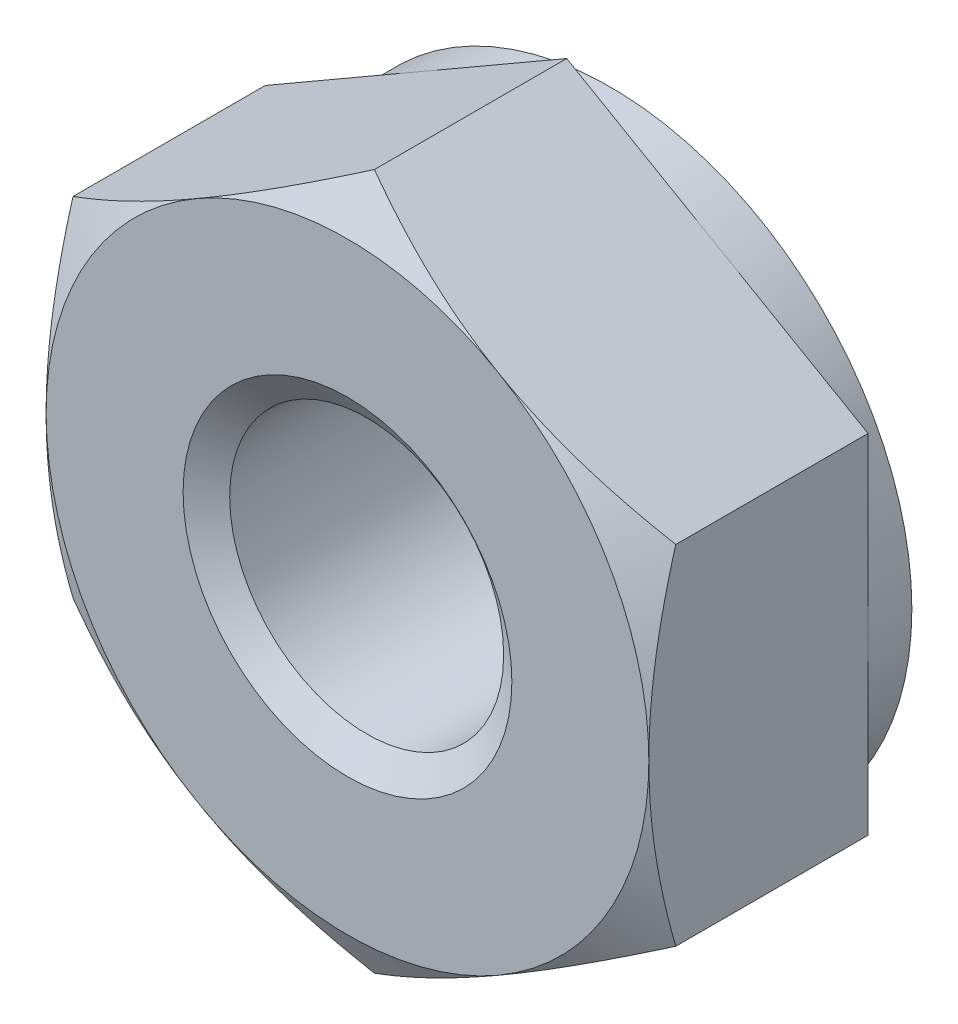
ISO-10303-21;
HEADER;
FILE_DESCRIPTION(('STEP AP214'),'2;1');
FILE_NAME('part.step','',(''),(''),'','','');
FILE_SCHEMA(('AUTOMOTIVE_DESIGN { 1 0 10303 214 1 1 1 1 }'));
ENDSEC;
DATA;
#1=APPLICATION_CONTEXT('core data for automotive mechanical design processes');
#2=APPLICATION_PROTOCOL_DEFINITION('international standard','automotive_design',2000,#1);
#3=PRODUCT_CONTEXT('',#1,'mechanical');
#4=PRODUCT('Part','Part','',(#3));
#5=PRODUCT_RELATED_PRODUCT_CATEGORY('part','',(#4));
#6=PRODUCT_DEFINITION_FORMATION('','',#4);
#7=PRODUCT_DEFINITION_CONTEXT('part definition',#1,'design');
#8=PRODUCT_DEFINITION('design','',#6,#7);
#9=PRODUCT_DEFINITION_SHAPE('','',#8);
#10=(LENGTH_UNIT() NAMED_UNIT(*) SI_UNIT(.MILLI.,.METRE.));
#11=(NAMED_UNIT(*) PLANE_ANGLE_UNIT() SI_UNIT($,.RADIAN.));
#12=(NAMED_UNIT(*) SI_UNIT($,.STERADIAN.) SOLID_ANGLE_UNIT());
#13=UNCERTAINTY_MEASURE_WITH_UNIT(LENGTH_MEASURE(1.E-05),#10,'distance_accuracy_value','');
#14=(GEOMETRIC_REPRESENTATION_CONTEXT(3) GLOBAL_UNCERTAINTY_ASSIGNED_CONTEXT((#13)) GLOBAL_UNIT_ASSIGNED_CONTEXT((#10,
#11,#12)) REPRESENTATION_CONTEXT('',''));
#15=CARTESIAN_POINT('',(0.,0.,0.));
#16=DIRECTION('',(0.,0.,1.));
#17=DIRECTION('',(1.,0.,0.));
#18=AXIS2_PLACEMENT_3D('',#15,#16,#17);
#19=CARTESIAN_POINT('',(0.,0.,-2.4));
#20=DIRECTION('',(0.,0.,1.));
#21=DIRECTION('',(1.,0.,0.));
#22=AXIS2_PLACEMENT_3D('',#19,#20,#21);
#23=CYLINDRICAL_SURFACE('',#22,1.25);
#24=CARTESIAN_POINT('',(0.,0.,-0.175051884552426));
#25=DIRECTION('',(0.,0.,1.));
#26=DIRECTION('',(1.,0.,0.));
#27=AXIS2_PLACEMENT_3D('',#24,#25,#26);
#28=CIRCLE('',#27,1.25);
#29=CARTESIAN_POINT('',(1.25,0.,-0.175051884552426));
#30=VERTEX_POINT('',#29);
#31=EDGE_CURVE('E153',#30,#30,#28,.F.);
#32=ORIENTED_EDGE('',*,*,#31,.F.);
#33=EDGE_LOOP('',(#32));
#34=FACE_BOUND('',#33,.T.);
#35=CARTESIAN_POINT('',(0.,0.,-2.19954811544757));
#36=DIRECTION('',(0.,0.,-1.));
#37=DIRECTION('',(-1.,0.,0.));
#38=AXIS2_PLACEMENT_3D('',#35,#36,#37);
#39=CIRCLE('',#38,1.25);
#40=CARTESIAN_POINT('',(-1.25,0.,-2.19954811544757));
#41=VERTEX_POINT('',#40);
#42=EDGE_CURVE('E41',#41,#41,#39,.F.);
#43=ORIENTED_EDGE('',*,*,#42,.F.);
#44=EDGE_LOOP('',(#43));
#45=FACE_BOUND('',#44,.T.);
#46=ADVANCED_FACE('F36',(#34,#45),#23,.F.);
#47=CARTESIAN_POINT('',(0.,3.17542648054294,-2.4));
#48=DIRECTION('',(-0.5,0.866025403784438,0.));
#49=DIRECTION('',(-0.866025403784439,-0.5,0.));
#50=AXIS2_PLACEMENT_3D('',#47,#48,#49);
#51=PLANE('',#50);
#52=DIRECTION('',(0.,0.,1.));
#53=VECTOR('',#52,1.);
#54=CARTESIAN_POINT('',(-2.75,1.58771324027147,-2.4));
#55=LINE('',#54,#53);
#56=CARTESIAN_POINT('',(-2.75,1.58771324027147,-2.));
#57=VERTEX_POINT('',#56);
#58=CARTESIAN_POINT('',(-2.75,1.58771324027147,-0.245620093061864));
#59=VERTEX_POINT('',#58);
#60=EDGE_CURVE('E294',#57,#59,#55,.T.);
#61=ORIENTED_EDGE('',*,*,#60,.T.);
#62=CARTESIAN_POINT('',(-2.7502,1.58759777021763,-0.245686763364762));
#63=CARTESIAN_POINT('',(-2.62935077934009,1.65737010029699,-0.205387662249264));
#64=CARTESIAN_POINT('',(-2.50745839737737,1.72774469983533,-0.168736902597663));
#65=CARTESIAN_POINT('',(-2.26156287327211,1.86971254687003,-0.104762182969801));
#66=CARTESIAN_POINT('',(-2.13755536142614,1.94130831721583,-0.0774608556744977));
#67=CARTESIAN_POINT('',(-1.89107720202405,2.08361254889599,-0.034961745294117));
#68=CARTESIAN_POINT('',(-1.76864448141258,2.15429911309864,-0.0194811186224577));
#69=CARTESIAN_POINT('',(-1.52320285763108,2.29600490065923,-0.000999397369940291));
#70=CARTESIAN_POINT('',(-1.40019484676709,2.36702360884404,0.00201700053740032));
#71=CARTESIAN_POINT('',(-1.17034121338921,2.49972966594897,-0.00425314542854684));
#72=CARTESIAN_POINT('',(-1.06346120874598,2.56143686540073,-0.0120001542767026));
#73=CARTESIAN_POINT('',(-0.850397532665249,2.68444923614047,-0.0365551810643552));
#74=CARTESIAN_POINT('',(-0.74421459835111,2.74575398185008,-0.0533715896505709));
#75=CARTESIAN_POINT('',(-0.530711510606815,2.86902004703207,-0.0954119223459574));
#76=CARTESIAN_POINT('',(-0.423418383857144,2.93096576264318,-0.120814080687232));
#77=CARTESIAN_POINT('',(-0.210432520715948,3.05393320806134,-0.178467225839984));
#78=CARTESIAN_POINT('',(-0.104737054973346,3.11495651365995,-0.210704663298984));
#79=CARTESIAN_POINT('',(0.000200000000000739,3.17554195059678,-0.245686763364762));
#80=B_SPLINE_CURVE_WITH_KNOTS('',3,(#62,#63,#64,#65,#66,#67,#68,#69,#70,#71,#72,#73,#74,#75,#76,
#77,#78,#79),.UNSPECIFIED.,.F.,.F.,(4,2,2,2,2,2,2,2,4),(0.,0.435912828725889,0.872873557116334,
1.29901931904672,1.72464171213574,2.09526089052938,2.46622354066374,2.84541551798557,
3.22386274754524),.UNSPECIFIED.);
#81=CARTESIAN_POINT('',(-1.375,2.38156986040721,0.));
#82=VERTEX_POINT('',#81);
#83=EDGE_CURVE('E60',#59,#82,#80,.T.);
#84=ORIENTED_EDGE('',*,*,#83,.T.);
#85=CARTESIAN_POINT('',(0.,3.17542648054294,-0.245620093061864));
#86=VERTEX_POINT('',#85);
#87=EDGE_CURVE('E167',#82,#86,#80,.T.);
#88=ORIENTED_EDGE('',*,*,#87,.T.);
#89=DIRECTION('',(0.,0.,1.));
#90=VECTOR('',#89,1.);
#91=CARTESIAN_POINT('',(0.,3.17542648054294,-2.4));
#92=LINE('',#91,#90);
#93=CARTESIAN_POINT('',(0.,3.17542648054294,-2.));
#94=VERTEX_POINT('',#93);
#95=EDGE_CURVE('E282',#94,#86,#92,.T.);
#96=ORIENTED_EDGE('',*,*,#95,.F.);
#97=DIRECTION('',(-0.866025403784439,-0.5,0.));
#98=VECTOR('',#97,1.);
#99=CARTESIAN_POINT('',(0.,3.17542648054294,-2.));
#100=LINE('',#99,#98);
#101=CARTESIAN_POINT('',(-1.375,2.38156986040721,-2.));
#102=VERTEX_POINT('',#101);
#103=EDGE_CURVE('E270',#94,#102,#100,.T.);
#104=ORIENTED_EDGE('',*,*,#103,.T.);
#105=EDGE_CURVE('E266',#102,#57,#100,.T.);
#106=ORIENTED_EDGE('',*,*,#105,.T.);
#107=EDGE_LOOP('',(#61,#84,#88,#96,#104,#106));
#108=FACE_BOUND('',#107,.T.);
#109=ADVANCED_FACE('F38',(#108),#51,.T.);
#110=CARTESIAN_POINT('',(2.75,1.58771324027147,-2.4));
#111=DIRECTION('',(0.500000000000001,0.866025403784438,0.));
#112=DIRECTION('',(-0.866025403784438,0.500000000000001,0.));
#113=AXIS2_PLACEMENT_3D('',#110,#111,#112);
#114=PLANE('',#113);
#115=ORIENTED_EDGE('',*,*,#95,.T.);
#116=CARTESIAN_POINT('',(-0.000199999999999462,3.17554195059678,-0.245686763364762));
#117=CARTESIAN_POINT('',(0.120649220659907,3.10576962051743,-0.205387662249265));
#118=CARTESIAN_POINT('',(0.242541602622635,3.03539502097908,-0.168736902597663));
#119=CARTESIAN_POINT('',(0.488437126727894,2.89342717394439,-0.104762182969801));
#120=CARTESIAN_POINT('',(0.612444638573857,2.82183140359858,-0.0774608556744977));
#121=CARTESIAN_POINT('',(0.858922797975945,2.67952717191842,-0.0349617452941167));
#122=CARTESIAN_POINT('',(0.981355518587418,2.60884060771577,-0.0194811186224576));
#123=CARTESIAN_POINT('',(1.22679714236892,2.46713482015518,-0.000999397369940055));
#124=CARTESIAN_POINT('',(1.34980515323291,2.39611611197037,0.00201700053740075));
#125=CARTESIAN_POINT('',(1.57965878661079,2.26341005486544,-0.00425314542854627));
#126=CARTESIAN_POINT('',(1.68653879125402,2.20170285541368,-0.012000154276702));
#127=CARTESIAN_POINT('',(1.89960246733475,2.07869048467395,-0.0365551810643545));
#128=CARTESIAN_POINT('',(2.00578540164889,2.01738573896433,-0.0533715896505701));
#129=CARTESIAN_POINT('',(2.21928848939318,1.89411967378235,-0.0954119223459562));
#130=CARTESIAN_POINT('',(2.32658161614286,1.83217395817123,-0.120814080687231));
#131=CARTESIAN_POINT('',(2.53956747928405,1.70920651275307,-0.178467225839982));
#132=CARTESIAN_POINT('',(2.64526294502665,1.64818320715446,-0.210704663298983));
#133=CARTESIAN_POINT('',(2.7502,1.58759777021763,-0.245686763364761));
#134=B_SPLINE_CURVE_WITH_KNOTS('',3,(#116,#117,#118,#119,#120,#121,#122,#123,#124,#125,#126,
#127,#128,#129,#130,#131,#132,#133),.UNSPECIFIED.,.F.,.F.,(4,2,2,2,2,2,2,2,4),(0.,
0.435912828725889,0.872873557116333,1.29901931904672,1.72464171213574,2.09526089052938,
2.46622354066374,2.84541551798557,3.22386274754524),.UNSPECIFIED.);
#135=CARTESIAN_POINT('',(1.375,2.3815698604072,0.));
#136=VERTEX_POINT('',#135);
#137=EDGE_CURVE('E164',#86,#136,#134,.T.);
#138=ORIENTED_EDGE('',*,*,#137,.T.);
#139=CARTESIAN_POINT('',(2.75,1.58771324027147,-0.245620093061864));
#140=VERTEX_POINT('',#139);
#141=EDGE_CURVE('E147',#136,#140,#134,.T.);
#142=ORIENTED_EDGE('',*,*,#141,.T.);
#143=DIRECTION('',(0.,0.,1.));
#144=VECTOR('',#143,1.);
#145=CARTESIAN_POINT('',(2.75,1.58771324027147,-2.4));
#146=LINE('',#145,#144);
#147=CARTESIAN_POINT('',(2.75,1.58771324027147,-2.));
#148=VERTEX_POINT('',#147);
#149=EDGE_CURVE('E163',#148,#140,#146,.T.);
#150=ORIENTED_EDGE('',*,*,#149,.F.);
#151=DIRECTION('',(-0.866025403784438,0.500000000000001,0.));
#152=VECTOR('',#151,1.);
#153=CARTESIAN_POINT('',(2.75,1.58771324027147,-2.));
#154=LINE('',#153,#152);
#155=CARTESIAN_POINT('',(1.375,2.38156986040721,-2.));
#156=VERTEX_POINT('',#155);
#157=EDGE_CURVE('E278',#148,#156,#154,.T.);
#158=ORIENTED_EDGE('',*,*,#157,.T.);
#159=EDGE_CURVE('E274',#156,#94,#154,.T.);
#160=ORIENTED_EDGE('',*,*,#159,.T.);
#161=EDGE_LOOP('',(#115,#138,#142,#150,#158,#160));
#162=FACE_BOUND('',#161,.T.);
#163=ADVANCED_FACE('F241',(#162),#114,.T.);
#164=CARTESIAN_POINT('',(2.75,1.58771324027147,-2.4));
#165=DIRECTION('',(-1.,0.,0.));
#166=DIRECTION('',(0.,0.,1.));
#167=AXIS2_PLACEMENT_3D('',#164,#165,#166);
#168=PLANE('',#167);
#169=CARTESIAN_POINT('',(2.75,-4.21084949309676,-1.31594843960294));
#170=CARTESIAN_POINT('',(2.75,-4.0901089421409,-1.25759993615224));
#171=CARTESIAN_POINT('',(2.75,-3.96908292065509,-1.19983146511759));
#172=CARTESIAN_POINT('',(2.75,-3.72630558284844,-1.08578603842305));
#173=CARTESIAN_POINT('',(2.75,-3.604554145362,-1.02950934100247));
#174=CARTESIAN_POINT('',(2.75,-3.35951393034354,-0.918482443352759));
#175=CARTESIAN_POINT('',(2.75,-3.23622034236436,-0.86374282160584));
#176=CARTESIAN_POINT('',(2.75,-2.98861980138743,-0.756614777476455));
#177=CARTESIAN_POINT('',(2.75,-2.86431290161182,-0.704226232536765));
#178=CARTESIAN_POINT('',(2.75,-2.61294485887172,-0.601803572146125));
#179=CARTESIAN_POINT('',(2.75,-2.48586863815654,-0.551806257898394));
#180=CARTESIAN_POINT('',(2.75,-2.23021732171541,-0.455727408784602));
#181=CARTESIAN_POINT('',(2.75,-2.10164206103363,-0.409646309576972));
#182=CARTESIAN_POINT('',(2.75,-1.84305218799467,-0.322638077046232));
#183=CARTESIAN_POINT('',(2.75,-1.71304130052583,-0.281699986413889));
#184=CARTESIAN_POINT('',(2.75,-1.45117125062148,-0.206307307624348));
#185=CARTESIAN_POINT('',(2.75,-1.31931268690202,-0.171850669152767));
#186=CARTESIAN_POINT('',(2.75,-1.05365722480012,-0.111093671530904));
#187=CARTESIAN_POINT('',(2.75,-0.919859820217592,-0.0847954840951217));
#188=CARTESIAN_POINT('',(2.75,-0.650651874037381,-0.0421260371966114));
#189=CARTESIAN_POINT('',(2.75,-0.515241331013595,-0.0257547865105431));
#190=CARTESIAN_POINT('',(2.75,-0.244373242869211,-0.00438749654023741));
#191=CARTESIAN_POINT('',(2.75,-0.108921526377133,0.000680556773215934));
#192=CARTESIAN_POINT('',(2.75,0.161887058855134,-0.000827795632671984));
#193=CARTESIAN_POINT('',(2.75,0.297243943089641,-0.00740117868555361));
#194=CARTESIAN_POINT('',(2.75,0.528385436717542,-0.0281041300468438));
#195=CARTESIAN_POINT('',(2.75,0.624425050137501,-0.0395376410301884));
#196=CARTESIAN_POINT('',(2.75,0.815762399811543,-0.0675217196133512));
#197=CARTESIAN_POINT('',(2.75,0.911060016631966,-0.0840730942276825));
#198=CARTESIAN_POINT('',(2.75,1.19576218748916,-0.140535361278284));
#199=CARTESIAN_POINT('',(2.75,1.38383224738496,-0.187239859417294));
#200=CARTESIAN_POINT('',(2.75,1.66525048947485,-0.267792497030578));
#201=CARTESIAN_POINT('',(2.75,1.76006556248558,-0.296803334995501));
#202=CARTESIAN_POINT('',(2.75,1.94870609382215,-0.357695648906588));
#203=CARTESIAN_POINT('',(2.75,2.04253218553696,-0.389575144878503));
#204=CARTESIAN_POINT('',(2.75,2.22880240354984,-0.455541418186448));
#205=CARTESIAN_POINT('',(2.75,2.32125133588451,-0.489614761455532));
#206=CARTESIAN_POINT('',(2.75,2.50543192042628,-0.559761368231109));
#207=CARTESIAN_POINT('',(2.75,2.59716326539579,-0.595835440037317));
#208=CARTESIAN_POINT('',(2.75,2.68856293053345,-0.632712441997484));
#209=B_SPLINE_CURVE_WITH_KNOTS('',3,(#169,#170,#171,#172,#173,#174,#175,#176,#177,#178,#179,
#180,#181,#182,#183,#184,#185,#186,#187,#188,#189,#190,#191,#192,#193,#194,#195,#196,#197,#198,
#199,#200,#201,#202,#203,#204,#205,#206,#207,#208),.UNSPECIFIED.,.F.,.F.,(4,2,2,2,2,2,2,2,2,2,2,
2,2,2,2,2,2,2,2,4),(0.,0.402305607365936,0.804680408536997,1.20935783819118,1.61401414820818,
2.0236383818577,2.43330812457349,2.842089694796,3.25074173456636,3.65950246109143,
4.06826354901184,4.4744128402465,4.88045669141172,5.17046846817546,5.46052599902452,
6.04107275309883,6.33851131304661,6.63574613017455,6.93130791005792,7.22698998004822),.UNSPECIFIED.);
#210=CARTESIAN_POINT('',(2.75,-1.58771324027147,-0.245620093061864));
#211=VERTEX_POINT('',#210);
#212=CARTESIAN_POINT('',(2.75,0.,0.));
#213=VERTEX_POINT('',#212);
#214=EDGE_CURVE('E128',#211,#213,#209,.T.);
#215=ORIENTED_EDGE('',*,*,#214,.F.);
#216=DIRECTION('',(0.,0.,1.));
#217=VECTOR('',#216,1.);
#218=CARTESIAN_POINT('',(2.75,-1.58771324027147,-2.4));
#219=LINE('',#218,#217);
#220=CARTESIAN_POINT('',(2.75,-1.58771324027147,-2.));
#221=VERTEX_POINT('',#220);
#222=EDGE_CURVE('E287',#221,#211,#219,.T.);
#223=ORIENTED_EDGE('',*,*,#222,.F.);
#224=DIRECTION('',(0.,-1.,0.));
#225=VECTOR('',#224,1.);
#226=CARTESIAN_POINT('',(2.75,1.58771324027147,-2.));
#227=LINE('',#226,#225);
#228=CARTESIAN_POINT('',(2.75,0.,-2.));
#229=VERTEX_POINT('',#228);
#230=EDGE_CURVE('E279',#229,#221,#227,.T.);
#231=ORIENTED_EDGE('',*,*,#230,.F.);
#232=EDGE_CURVE('E281',#148,#229,#227,.T.);
#233=ORIENTED_EDGE('',*,*,#232,.F.);
#234=ORIENTED_EDGE('',*,*,#149,.T.);
#235=EDGE_CURVE('E141',#213,#140,#209,.T.);
#236=ORIENTED_EDGE('',*,*,#235,.F.);
#237=EDGE_LOOP('',(#215,#223,#231,#233,#234,#236));
#238=FACE_BOUND('',#237,.T.);
#239=ADVANCED_FACE('F160',(#238),#168,.F.);
#240=CARTESIAN_POINT('',(0.,-3.17542648054295,-2.4));
#241=DIRECTION('',(0.5,-0.866025403784439,0.));
#242=DIRECTION('',(0.866025403784439,0.5,0.));
#243=AXIS2_PLACEMENT_3D('',#240,#241,#242);
#244=PLANE('',#243);
#245=ORIENTED_EDGE('',*,*,#222,.T.);
#246=CARTESIAN_POINT('',(2.7502,-1.58759777021764,-0.245686763364762));
#247=CARTESIAN_POINT('',(2.62935077934009,-1.65737010029699,-0.205387662249265));
#248=CARTESIAN_POINT('',(2.50745839737737,-1.72774469983534,-0.168736902597663));
#249=CARTESIAN_POINT('',(2.26156287327211,-1.86971254687003,-0.104762182969802));
#250=CARTESIAN_POINT('',(2.13755536142614,-1.94130831721583,-0.0774608556744985));
#251=CARTESIAN_POINT('',(1.89107720202405,-2.08361254889599,-0.0349617452941179));
#252=CARTESIAN_POINT('',(1.76864448141258,-2.15429911309864,-0.0194811186224588));
#253=CARTESIAN_POINT('',(1.52320285763108,-2.29600490065923,-0.000999397369941431));
#254=CARTESIAN_POINT('',(1.40019484676709,-2.36702360884404,0.00201700053739928));
#255=CARTESIAN_POINT('',(1.1703412133892,-2.49972966594897,-0.00425314542854804));
#256=CARTESIAN_POINT('',(1.06346120874598,-2.56143686540073,-0.012000154276704));
#257=CARTESIAN_POINT('',(0.850397532665248,-2.68444923614047,-0.0365551810643568));
#258=CARTESIAN_POINT('',(0.744214598351109,-2.74575398185008,-0.0533715896505724));
#259=CARTESIAN_POINT('',(0.530711510606815,-2.86902004703207,-0.0954119223459588));
#260=CARTESIAN_POINT('',(0.423418383857143,-2.93096576264319,-0.120814080687233));
#261=CARTESIAN_POINT('',(0.210432520715948,-3.05393320806134,-0.178467225839985));
#262=CARTESIAN_POINT('',(0.104737054973347,-3.11495651365995,-0.210704663298985));
#263=CARTESIAN_POINT('',(-0.000200000000000457,-3.17554195059678,-0.245686763364763));
#264=B_SPLINE_CURVE_WITH_KNOTS('',3,(#246,#247,#248,#249,#250,#251,#252,#253,#254,#255,#256,
#257,#258,#259,#260,#261,#262,#263),.UNSPECIFIED.,.F.,.F.,(4,2,2,2,2,2,2,2,4),(0.,
0.435912828725889,0.872873557116334,1.29901931904672,1.72464171213574,2.09526089052938,
2.46622354066375,2.84541551798557,3.22386274754524),.UNSPECIFIED.);
#265=CARTESIAN_POINT('',(1.375,-2.38156986040721,0.));
#266=VERTEX_POINT('',#265);
#267=EDGE_CURVE('E135',#211,#266,#264,.T.);
#268=ORIENTED_EDGE('',*,*,#267,.T.);
#269=CARTESIAN_POINT('',(0.,-3.17542648054294,-0.245620093061864));
#270=VERTEX_POINT('',#269);
#271=EDGE_CURVE('E175',#266,#270,#264,.T.);
#272=ORIENTED_EDGE('',*,*,#271,.T.);
#273=DIRECTION('',(0.,0.,1.));
#274=VECTOR('',#273,1.);
#275=CARTESIAN_POINT('',(0.,-3.17542648054295,-2.4));
#276=LINE('',#275,#274);
#277=CARTESIAN_POINT('',(0.,-3.17542648054295,-2.));
#278=VERTEX_POINT('',#277);
#279=EDGE_CURVE('E289',#278,#270,#276,.T.);
#280=ORIENTED_EDGE('',*,*,#279,.F.);
#281=DIRECTION('',(0.866025403784439,0.5,0.));
#282=VECTOR('',#281,1.);
#283=CARTESIAN_POINT('',(0.,-3.17542648054295,-2.));
#284=LINE('',#283,#282);
#285=CARTESIAN_POINT('',(1.375,-2.38156986040721,-2.));
#286=VERTEX_POINT('',#285);
#287=EDGE_CURVE('E271',#278,#286,#284,.T.);
#288=ORIENTED_EDGE('',*,*,#287,.T.);
#289=EDGE_CURVE('E275',#286,#221,#284,.T.);
#290=ORIENTED_EDGE('',*,*,#289,.T.);
#291=EDGE_LOOP('',(#245,#268,#272,#280,#288,#290));
#292=FACE_BOUND('',#291,.T.);
#293=ADVANCED_FACE('F222',(#292),#244,.T.);
#294=CARTESIAN_POINT('',(-2.75,-1.58771324027147,-2.4));
#295=DIRECTION('',(-0.500000000000001,-0.866025403784438,0.));
#296=DIRECTION('',(0.866025403784438,-0.500000000000001,0.));
#297=AXIS2_PLACEMENT_3D('',#294,#295,#296);
#298=PLANE('',#297);
#299=ORIENTED_EDGE('',*,*,#279,.T.);
#300=CARTESIAN_POINT('',(0.000199999999999374,-3.17554195059678,-0.245686763364763));
#301=CARTESIAN_POINT('',(-0.120649220659907,-3.10576962051743,-0.205387662249266));
#302=CARTESIAN_POINT('',(-0.242541602622635,-3.03539502097908,-0.168736902597664));
#303=CARTESIAN_POINT('',(-0.488437126727894,-2.89342717394439,-0.104762182969802));
#304=CARTESIAN_POINT('',(-0.612444638573857,-2.82183140359859,-0.0774608556744988));
#305=CARTESIAN_POINT('',(-0.858922797975946,-2.67952717191843,-0.0349617452941179));
#306=CARTESIAN_POINT('',(-0.981355518587419,-2.60884060771577,-0.0194811186224589));
#307=CARTESIAN_POINT('',(-1.22679714236892,-2.46713482015519,-0.000999397369941341));
#308=CARTESIAN_POINT('',(-1.34980515323291,-2.39611611197038,0.00201700053739963));
#309=CARTESIAN_POINT('',(-1.5796587866108,-2.26341005486544,-0.00425314542854729));
#310=CARTESIAN_POINT('',(-1.68653879125402,-2.20170285541369,-0.012000154276703));
#311=CARTESIAN_POINT('',(-1.89960246733475,-2.07869048467395,-0.0365551810643555));
#312=CARTESIAN_POINT('',(-2.00578540164889,-2.01738573896433,-0.0533715896505711));
#313=CARTESIAN_POINT('',(-2.21928848939318,-1.89411967378235,-0.0954119223459572));
#314=CARTESIAN_POINT('',(-2.32658161614286,-1.83217395817123,-0.120814080687232));
#315=CARTESIAN_POINT('',(-2.53956747928405,-1.70920651275308,-0.178467225839983));
#316=CARTESIAN_POINT('',(-2.64526294502665,-1.64818320715446,-0.210704663298984));
#317=CARTESIAN_POINT('',(-2.7502,-1.58759777021763,-0.245686763364762));
#318=B_SPLINE_CURVE_WITH_KNOTS('',3,(#300,#301,#302,#303,#304,#305,#306,#307,#308,#309,#310,
#311,#312,#313,#314,#315,#316,#317),.UNSPECIFIED.,.F.,.F.,(4,2,2,2,2,2,2,2,4),(0.,
0.435912828725889,0.872873557116334,1.29901931904672,1.72464171213574,2.09526089052938,
2.46622354066375,2.84541551798557,3.22386274754524),.UNSPECIFIED.);
#319=CARTESIAN_POINT('',(-1.375,-2.38156986040721,0.));
#320=VERTEX_POINT('',#319);
#321=EDGE_CURVE('E216',#270,#320,#318,.T.);
#322=ORIENTED_EDGE('',*,*,#321,.T.);
#323=CARTESIAN_POINT('',(-2.75,-1.58771324027147,-0.245620093061864));
#324=VERTEX_POINT('',#323);
#325=EDGE_CURVE('E208',#320,#324,#318,.T.);
#326=ORIENTED_EDGE('',*,*,#325,.T.);
#327=DIRECTION('',(0.,0.,1.));
#328=VECTOR('',#327,1.);
#329=CARTESIAN_POINT('',(-2.75,-1.58771324027147,-2.4));
#330=LINE('',#329,#328);
#331=CARTESIAN_POINT('',(-2.75,-1.58771324027147,-2.));
#332=VERTEX_POINT('',#331);
#333=EDGE_CURVE('E292',#332,#324,#330,.T.);
#334=ORIENTED_EDGE('',*,*,#333,.F.);
#335=DIRECTION('',(0.866025403784438,-0.500000000000001,0.));
#336=VECTOR('',#335,1.);
#337=CARTESIAN_POINT('',(-2.75,-1.58771324027147,-2.));
#338=LINE('',#337,#336);
#339=CARTESIAN_POINT('',(-1.375,-2.38156986040721,-2.));
#340=VERTEX_POINT('',#339);
#341=EDGE_CURVE('E261',#332,#340,#338,.T.);
#342=ORIENTED_EDGE('',*,*,#341,.T.);
#343=EDGE_CURVE('E267',#340,#278,#338,.T.);
#344=ORIENTED_EDGE('',*,*,#343,.T.);
#345=EDGE_LOOP('',(#299,#322,#326,#334,#342,#344));
#346=FACE_BOUND('',#345,.T.);
#347=ADVANCED_FACE('F218',(#346),#298,.T.);
#348=CARTESIAN_POINT('',(-2.75,1.58771324027147,-2.4));
#349=DIRECTION('',(-1.,0.,0.));
#350=DIRECTION('',(0.,0.,1.));
#351=AXIS2_PLACEMENT_3D('',#348,#349,#350);
#352=PLANE('',#351);
#353=ORIENTED_EDGE('',*,*,#333,.T.);
#354=CARTESIAN_POINT('',(-2.75,-4.21084949309676,-1.31594843960294));
#355=CARTESIAN_POINT('',(-2.75,-4.0901089421409,-1.25759993615224));
#356=CARTESIAN_POINT('',(-2.75,-3.96908292065509,-1.19983146511759));
#357=CARTESIAN_POINT('',(-2.75,-3.72630558284843,-1.08578603842305));
#358=CARTESIAN_POINT('',(-2.75,-3.604554145362,-1.02950934100247));
#359=CARTESIAN_POINT('',(-2.75,-3.35951393034354,-0.918482443352758));
#360=CARTESIAN_POINT('',(-2.75,-3.23622034236436,-0.863742821605839));
#361=CARTESIAN_POINT('',(-2.75,-2.98861980138743,-0.756614777476454));
#362=CARTESIAN_POINT('',(-2.75,-2.86431290161182,-0.704226232536764));
#363=CARTESIAN_POINT('',(-2.75,-2.61294485887172,-0.601803572146124));
#364=CARTESIAN_POINT('',(-2.75,-2.48586863815654,-0.551806257898393));
#365=CARTESIAN_POINT('',(-2.75,-2.2302173217154,-0.455727408784601));
#366=CARTESIAN_POINT('',(-2.75,-2.10164206103363,-0.409646309576971));
#367=CARTESIAN_POINT('',(-2.75,-1.84305218799467,-0.322638077046231));
#368=CARTESIAN_POINT('',(-2.75,-1.71304130052583,-0.281699986413888));
#369=CARTESIAN_POINT('',(-2.75,-1.45117125062147,-0.206307307624348));
#370=CARTESIAN_POINT('',(-2.75,-1.31931268690202,-0.171850669152767));
#371=CARTESIAN_POINT('',(-2.75,-1.05365722480012,-0.111093671530904));
#372=CARTESIAN_POINT('',(-2.75,-0.91985982021759,-0.0847954840951212));
#373=CARTESIAN_POINT('',(-2.75,-0.650651874037379,-0.0421260371966109));
#374=CARTESIAN_POINT('',(-2.75,-0.515241331013593,-0.025754786510543));
#375=CARTESIAN_POINT('',(-2.75,-0.244373242869209,-0.00438749654023751));
#376=CARTESIAN_POINT('',(-2.75,-0.108921526377131,0.000680556773215974));
#377=CARTESIAN_POINT('',(-2.75,0.161887058855136,-0.000827795632672024));
#378=CARTESIAN_POINT('',(-2.75,0.297243943089643,-0.00740117868555387));
#379=CARTESIAN_POINT('',(-2.75,0.528385436717545,-0.0281041300468441));
#380=CARTESIAN_POINT('',(-2.75,0.624425050137503,-0.0395376410301886));
#381=CARTESIAN_POINT('',(-2.75,0.815762399811546,-0.0675217196133515));
#382=CARTESIAN_POINT('',(-2.75,0.911060016631968,-0.0840730942276829));
#383=CARTESIAN_POINT('',(-2.75,1.19576218748917,-0.140535361278285));
#384=CARTESIAN_POINT('',(-2.75,1.38383224738497,-0.187239859417294));
#385=CARTESIAN_POINT('',(-2.75,1.66525048947485,-0.267792497030579));
#386=CARTESIAN_POINT('',(-2.75,1.76006556248558,-0.296803334995501));
#387=CARTESIAN_POINT('',(-2.75,1.94870609382215,-0.357695648906588));
#388=CARTESIAN_POINT('',(-2.75,2.04253218553696,-0.389575144878504));
#389=CARTESIAN_POINT('',(-2.75,2.22880240354985,-0.455541418186449));
#390=CARTESIAN_POINT('',(-2.75,2.32125133588451,-0.489614761455533));
#391=CARTESIAN_POINT('',(-2.75,2.50543192042629,-0.55976136823111));
#392=CARTESIAN_POINT('',(-2.75,2.59716326539579,-0.595835440037319));
#393=CARTESIAN_POINT('',(-2.75,2.68856293053346,-0.632712441997485));
#394=B_SPLINE_CURVE_WITH_KNOTS('',3,(#354,#355,#356,#357,#358,#359,#360,#361,#362,#363,#364,
#365,#366,#367,#368,#369,#370,#371,#372,#373,#374,#375,#376,#377,#378,#379,#380,#381,#382,#383,
#384,#385,#386,#387,#388,#389,#390,#391,#392,#393),.UNSPECIFIED.,.F.,.F.,(4,2,2,2,2,2,2,2,2,2,2,
2,2,2,2,2,2,2,2,4),(0.,0.402305607365936,0.804680408536997,1.20935783819118,1.61401414820818,
2.0236383818577,2.43330812457349,2.842089694796,3.25074173456636,3.65950246109143,
4.06826354901184,4.4744128402465,4.88045669141172,5.17046846817546,5.46052599902452,
6.04107275309883,6.33851131304661,6.63574613017454,6.93130791005792,7.22698998004822),.UNSPECIFIED.);
#395=CARTESIAN_POINT('',(-2.75,0.,0.));
#396=VERTEX_POINT('',#395);
#397=EDGE_CURVE('E217',#324,#396,#394,.T.);
#398=ORIENTED_EDGE('',*,*,#397,.T.);
#399=EDGE_CURVE('E152',#396,#59,#394,.T.);
#400=ORIENTED_EDGE('',*,*,#399,.T.);
#401=ORIENTED_EDGE('',*,*,#60,.F.);
#402=DIRECTION('',(0.,-1.,0.));
#403=VECTOR('',#402,1.);
#404=CARTESIAN_POINT('',(-2.75,1.58771324027147,-2.));
#405=LINE('',#404,#403);
#406=CARTESIAN_POINT('',(-2.75,0.,-2.));
#407=VERTEX_POINT('',#406);
#408=EDGE_CURVE('E301',#57,#407,#405,.T.);
#409=ORIENTED_EDGE('',*,*,#408,.T.);
#410=EDGE_CURVE('E299',#407,#332,#405,.T.);
#411=ORIENTED_EDGE('',*,*,#410,.T.);
#412=EDGE_LOOP('',(#353,#398,#400,#401,#409,#411));
#413=FACE_BOUND('',#412,.T.);
#414=ADVANCED_FACE('F221',(#413),#352,.T.);
#415=CARTESIAN_POINT('',(0.,3.17542648054294,0.));
#416=DIRECTION('',(0.,0.,-1.));
#417=DIRECTION('',(-1.,0.,0.));
#418=AXIS2_PLACEMENT_3D('',#415,#416,#417);
#419=PLANE('',#418);
#420=CARTESIAN_POINT('',(0.,0.,0.));
#421=DIRECTION('',(0.,0.,1.));
#422=DIRECTION('',(1.,0.,0.));
#423=AXIS2_PLACEMENT_3D('',#420,#421,#422);
#424=CIRCLE('',#423,1.5);
#425=CARTESIAN_POINT('',(1.5,0.,0.));
#426=VERTEX_POINT('',#425);
#427=EDGE_CURVE('E304',#426,#426,#424,.T.);
#428=ORIENTED_EDGE('',*,*,#427,.F.);
#429=EDGE_LOOP('',(#428));
#430=FACE_BOUND('',#429,.T.);
#431=CARTESIAN_POINT('',(0.,0.,0.));
#432=DIRECTION('',(0.,0.,-1.));
#433=DIRECTION('',(-1.,0.,0.));
#434=AXIS2_PLACEMENT_3D('',#431,#432,#433);
#435=CIRCLE('',#434,2.75);
#436=EDGE_CURVE('E48',#82,#396,#435,.F.);
#437=ORIENTED_EDGE('',*,*,#436,.T.);
#438=EDGE_CURVE('E12',#396,#320,#435,.F.);
#439=ORIENTED_EDGE('',*,*,#438,.T.);
#440=EDGE_CURVE('E46',#320,#266,#435,.F.);
#441=ORIENTED_EDGE('',*,*,#440,.T.);
#442=EDGE_CURVE('E132',#266,#213,#435,.F.);
#443=ORIENTED_EDGE('',*,*,#442,.T.);
#444=CARTESIAN_POINT('',(0.,0.,0.));
#445=DIRECTION('',(0.,0.,1.));
#446=DIRECTION('',(1.,0.,0.));
#447=AXIS2_PLACEMENT_3D('',#444,#445,#446);
#448=CIRCLE('',#447,2.75);
#449=EDGE_CURVE('E144',#213,#136,#448,.T.);
#450=ORIENTED_EDGE('',*,*,#449,.T.);
#451=EDGE_CURVE('E158',#136,#82,#435,.F.);
#452=ORIENTED_EDGE('',*,*,#451,.T.);
#453=EDGE_LOOP('',(#437,#439,#441,#443,#450,#452));
#454=FACE_BOUND('',#453,.T.);
#455=ADVANCED_FACE('F156',(#430,#454),#419,.F.);
#456=CARTESIAN_POINT('',(0.,3.17542648054294,-2.4));
#457=DIRECTION('',(0.,0.,-1.));
#458=DIRECTION('',(-1.,0.,0.));
#459=AXIS2_PLACEMENT_3D('',#456,#457,#458);
#460=PLANE('',#459);
#461=CARTESIAN_POINT('',(0.,0.,-2.4));
#462=DIRECTION('',(0.,0.,-1.));
#463=DIRECTION('',(-1.,0.,0.));
#464=AXIS2_PLACEMENT_3D('',#461,#462,#463);
#465=CIRCLE('',#464,1.5);
#466=CARTESIAN_POINT('',(-1.5,0.,-2.4));
#467=VERTEX_POINT('',#466);
#468=EDGE_CURVE('E305',#467,#467,#465,.F.);
#469=ORIENTED_EDGE('',*,*,#468,.T.);
#470=EDGE_LOOP('',(#469));
#471=FACE_BOUND('',#470,.T.);
#472=CARTESIAN_POINT('',(0.,0.,-2.4));
#473=DIRECTION('',(0.,0.,-1.));
#474=DIRECTION('',(-1.,0.,0.));
#475=AXIS2_PLACEMENT_3D('',#472,#473,#474);
#476=CIRCLE('',#475,2.75);
#477=CARTESIAN_POINT('',(-2.75,0.,-2.4));
#478=VERTEX_POINT('',#477);
#479=EDGE_CURVE('E285',#478,#478,#476,.F.);
#480=ORIENTED_EDGE('',*,*,#479,.F.);
#481=EDGE_LOOP('',(#480));
#482=FACE_BOUND('',#481,.T.);
#483=ADVANCED_FACE('F231',(#471,#482),#460,.T.);
#484=CARTESIAN_POINT('',(0.,13.1754264805429,-2.));
#485=DIRECTION('',(0.,0.,-1.));
#486=DIRECTION('',(-1.,0.,0.));
#487=AXIS2_PLACEMENT_3D('',#484,#485,#486);
#488=PLANE('',#487);
#489=ORIENTED_EDGE('',*,*,#232,.T.);
#490=CARTESIAN_POINT('',(0.,0.,-2.));
#491=DIRECTION('',(0.,0.,1.));
#492=DIRECTION('',(1.,0.,0.));
#493=AXIS2_PLACEMENT_3D('',#490,#491,#492);
#494=CIRCLE('',#493,2.75);
#495=EDGE_CURVE('E258',#229,#156,#494,.T.);
#496=ORIENTED_EDGE('',*,*,#495,.T.);
#497=ORIENTED_EDGE('',*,*,#157,.F.);
#498=EDGE_LOOP('',(#489,#496,#497));
#499=FACE_BOUND('',#498,.T.);
#500=ADVANCED_FACE('F248',(#499),#488,.T.);
#501=ORIENTED_EDGE('',*,*,#230,.T.);
#502=ORIENTED_EDGE('',*,*,#289,.F.);
#503=EDGE_CURVE('E263',#286,#229,#494,.T.);
#504=ORIENTED_EDGE('',*,*,#503,.T.);
#505=EDGE_LOOP('',(#501,#502,#504));
#506=FACE_BOUND('',#505,.T.);
#507=ADVANCED_FACE('F451',(#506),#488,.T.);
#508=EDGE_CURVE('E262',#156,#102,#494,.T.);
#509=ORIENTED_EDGE('',*,*,#508,.T.);
#510=ORIENTED_EDGE('',*,*,#103,.F.);
#511=ORIENTED_EDGE('',*,*,#159,.F.);
#512=EDGE_LOOP('',(#509,#510,#511));
#513=FACE_BOUND('',#512,.T.);
#514=ADVANCED_FACE('F442',(#513),#488,.T.);
#515=ORIENTED_EDGE('',*,*,#343,.F.);
#516=EDGE_CURVE('E515',#340,#286,#494,.T.);
#517=ORIENTED_EDGE('',*,*,#516,.T.);
#518=ORIENTED_EDGE('',*,*,#287,.F.);
#519=EDGE_LOOP('',(#515,#517,#518));
#520=FACE_BOUND('',#519,.T.);
#521=ADVANCED_FACE('F433',(#520),#488,.T.);
#522=EDGE_CURVE('E529',#102,#407,#494,.T.);
#523=ORIENTED_EDGE('',*,*,#522,.T.);
#524=ORIENTED_EDGE('',*,*,#408,.F.);
#525=ORIENTED_EDGE('',*,*,#105,.F.);
#526=EDGE_LOOP('',(#523,#524,#525));
#527=FACE_BOUND('',#526,.T.);
#528=ADVANCED_FACE('F417',(#527),#488,.T.);
#529=CARTESIAN_POINT('',(0.,0.,0.));
#530=DIRECTION('',(0.,0.,1.));
#531=DIRECTION('',(1.,0.,0.));
#532=AXIS2_PLACEMENT_3D('',#529,#530,#531);
#533=CYLINDRICAL_SURFACE('',#532,2.75);
#534=ORIENTED_EDGE('',*,*,#479,.T.);
#535=EDGE_LOOP('',(#534));
#536=FACE_BOUND('',#535,.T.);
#537=ORIENTED_EDGE('',*,*,#508,.F.);
#538=ORIENTED_EDGE('',*,*,#495,.F.);
#539=ORIENTED_EDGE('',*,*,#503,.F.);
#540=ORIENTED_EDGE('',*,*,#516,.F.);
#541=EDGE_CURVE('E531',#407,#340,#494,.T.);
#542=ORIENTED_EDGE('',*,*,#541,.F.);
#543=ORIENTED_EDGE('',*,*,#522,.F.);
#544=EDGE_LOOP('',(#537,#538,#539,#540,#542,#543));
#545=FACE_BOUND('',#544,.T.);
#546=ADVANCED_FACE('F246',(#536,#545),#533,.T.);
#547=ORIENTED_EDGE('',*,*,#410,.F.);
#548=ORIENTED_EDGE('',*,*,#541,.T.);
#549=ORIENTED_EDGE('',*,*,#341,.F.);
#550=EDGE_LOOP('',(#547,#548,#549));
#551=FACE_BOUND('',#550,.T.);
#552=ADVANCED_FACE('F197',(#551),#488,.T.);
#553=CARTESIAN_POINT('',(0.,0.,0.));
#554=DIRECTION('',(0.,0.,-1.));
#555=DIRECTION('',(-1.,0.,0.));
#556=AXIS2_PLACEMENT_3D('',#553,#554,#555);
#557=CONICAL_SURFACE('',#556,2.75,1.0471975511966);
#558=ORIENTED_EDGE('',*,*,#399,.F.);
#559=ORIENTED_EDGE('',*,*,#436,.F.);
#560=ORIENTED_EDGE('',*,*,#83,.F.);
#561=EDGE_LOOP('',(#558,#559,#560));
#562=FACE_BOUND('',#561,.T.);
#563=ADVANCED_FACE('F379',(#562),#557,.T.);
#564=ORIENTED_EDGE('',*,*,#451,.F.);
#565=ORIENTED_EDGE('',*,*,#137,.F.);
#566=ORIENTED_EDGE('',*,*,#87,.F.);
#567=EDGE_LOOP('',(#564,#565,#566));
#568=FACE_BOUND('',#567,.T.);
#569=ADVANCED_FACE('F195',(#568),#557,.T.);
#570=ORIENTED_EDGE('',*,*,#449,.F.);
#571=ORIENTED_EDGE('',*,*,#235,.T.);
#572=ORIENTED_EDGE('',*,*,#141,.F.);
#573=EDGE_LOOP('',(#570,#571,#572));
#574=FACE_BOUND('',#573,.T.);
#575=ADVANCED_FACE('F145',(#574),#557,.T.);
#576=ORIENTED_EDGE('',*,*,#214,.T.);
#577=ORIENTED_EDGE('',*,*,#442,.F.);
#578=ORIENTED_EDGE('',*,*,#267,.F.);
#579=EDGE_LOOP('',(#576,#577,#578));
#580=FACE_BOUND('',#579,.T.);
#581=ADVANCED_FACE('F130',(#580),#557,.T.);
#582=ORIENTED_EDGE('',*,*,#440,.F.);
#583=ORIENTED_EDGE('',*,*,#321,.F.);
#584=ORIENTED_EDGE('',*,*,#271,.F.);
#585=EDGE_LOOP('',(#582,#583,#584));
#586=FACE_BOUND('',#585,.T.);
#587=ADVANCED_FACE('F194',(#586),#557,.T.);
#588=ORIENTED_EDGE('',*,*,#438,.F.);
#589=ORIENTED_EDGE('',*,*,#397,.F.);
#590=ORIENTED_EDGE('',*,*,#325,.F.);
#591=EDGE_LOOP('',(#588,#589,#590));
#592=FACE_BOUND('',#591,.T.);
#593=ADVANCED_FACE('F188',(#592),#557,.T.);
#594=CARTESIAN_POINT('',(0.,0.,-0.192557073007669));
#595=DIRECTION('',(0.,0.,1.));
#596=DIRECTION('',(1.,0.,0.));
#597=AXIS2_PLACEMENT_3D('',#594,#595,#596);
#598=CONICAL_SURFACE('',#597,1.225,0.959931088596884);
#599=ORIENTED_EDGE('',*,*,#427,.T.);
#600=EDGE_LOOP('',(#599));
#601=FACE_BOUND('',#600,.T.);
#602=ORIENTED_EDGE('',*,*,#31,.T.);
#603=EDGE_LOOP('',(#602));
#604=FACE_BOUND('',#603,.T.);
#605=ADVANCED_FACE('F193',(#601,#604),#598,.F.);
#606=CARTESIAN_POINT('',(0.,0.,-2.3746));
#607=DIRECTION('',(0.,0.,-1.));
#608=DIRECTION('',(-1.,0.,0.));
#609=AXIS2_PLACEMENT_3D('',#606,#607,#608);
#610=CONICAL_SURFACE('',#609,1.5,0.959931088596876);
#611=CARTESIAN_POINT('',(0.,0.,-2.3746));
#612=DIRECTION('',(0.,0.,1.));
#613=DIRECTION('',(1.,0.,0.));
#614=AXIS2_PLACEMENT_3D('',#611,#612,#613);
#615=CIRCLE('',#614,1.5);
#616=CARTESIAN_POINT('',(1.5,0.,-2.3746));
#617=VERTEX_POINT('',#616);
#618=EDGE_CURVE('E307',#617,#617,#615,.T.);
#619=ORIENTED_EDGE('',*,*,#618,.F.);
#620=EDGE_LOOP('',(#619));
#621=FACE_BOUND('',#620,.T.);
#622=ORIENTED_EDGE('',*,*,#42,.T.);
#623=EDGE_LOOP('',(#622));
#624=FACE_BOUND('',#623,.T.);
#625=ADVANCED_FACE('F320',(#621,#624),#610,.F.);
#626=CARTESIAN_POINT('',(0.,0.,-25.0375057290932));
#627=DIRECTION('',(0.,0.,1.));
#628=DIRECTION('',(1.,0.,0.));
#629=AXIS2_PLACEMENT_3D('',#626,#627,#628);
#630=CYLINDRICAL_SURFACE('',#629,1.5);
#631=ORIENTED_EDGE('',*,*,#468,.F.);
#632=EDGE_LOOP('',(#631));
#633=FACE_BOUND('',#632,.T.);
#634=ORIENTED_EDGE('',*,*,#618,.T.);
#635=EDGE_LOOP('',(#634));
#636=FACE_BOUND('',#635,.T.);
#637=ADVANCED_FACE('F324',(#633,#636),#630,.F.);
#638=CLOSED_SHELL('',(#46,#109,#163,#239,#293,#347,#414,#455,#483,#500,#507,#514,#521,#528,#546,
#552,#563,#569,#575,#581,#587,#593,#605,#625,#637));
#639=MANIFOLD_SOLID_BREP('B2',#638);
#640=ADVANCED_BREP_SHAPE_REPRESENTATION('',(#18,#639),#14);
#641=SHAPE_DEFINITION_REPRESENTATION(#9,#640);
ENDSEC;
END-ISO-10303-21;
